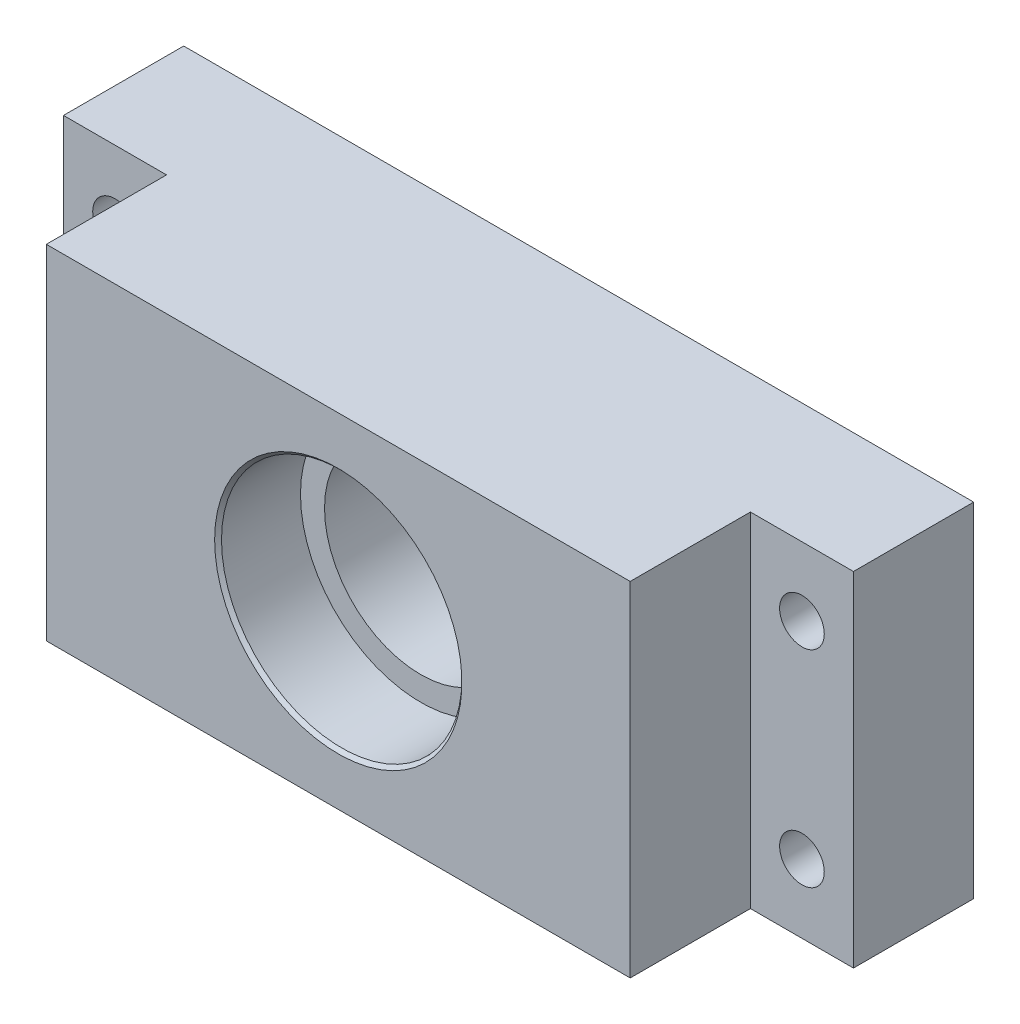
ISO-10303-21;
HEADER;
FILE_DESCRIPTION(('STEP AP214'),'2;1');
FILE_NAME('part.step','',(''),(''),'','','');
FILE_SCHEMA(('AUTOMOTIVE_DESIGN { 1 0 10303 214 1 1 1 1 }'));
ENDSEC;
DATA;
#1=APPLICATION_CONTEXT('core data for automotive mechanical design processes');
#2=APPLICATION_PROTOCOL_DEFINITION('international standard','automotive_design',2000,#1);
#3=PRODUCT_CONTEXT('',#1,'mechanical');
#4=PRODUCT('Part','Part','',(#3));
#5=PRODUCT_RELATED_PRODUCT_CATEGORY('part','',(#4));
#6=PRODUCT_DEFINITION_FORMATION('','',#4);
#7=PRODUCT_DEFINITION_CONTEXT('part definition',#1,'design');
#8=PRODUCT_DEFINITION('design','',#6,#7);
#9=PRODUCT_DEFINITION_SHAPE('','',#8);
#10=(LENGTH_UNIT() NAMED_UNIT(*) SI_UNIT(.MILLI.,.METRE.));
#11=(NAMED_UNIT(*) PLANE_ANGLE_UNIT() SI_UNIT($,.RADIAN.));
#12=(NAMED_UNIT(*) SI_UNIT($,.STERADIAN.) SOLID_ANGLE_UNIT());
#13=UNCERTAINTY_MEASURE_WITH_UNIT(LENGTH_MEASURE(1.E-05),#10,'distance_accuracy_value','');
#14=(GEOMETRIC_REPRESENTATION_CONTEXT(3) GLOBAL_UNCERTAINTY_ASSIGNED_CONTEXT((#13)) GLOBAL_UNIT_ASSIGNED_CONTEXT((#10,
#11,#12)) REPRESENTATION_CONTEXT('',''));
#15=CARTESIAN_POINT('',(0.,0.,0.));
#16=DIRECTION('',(0.,0.,1.));
#17=DIRECTION('',(1.,0.,0.));
#18=AXIS2_PLACEMENT_3D('',#15,#16,#17);
#19=CARTESIAN_POINT('',(57.5,-25.,35.));
#20=DIRECTION('',(-1.,0.,0.));
#21=DIRECTION('',(0.,0.,1.));
#22=AXIS2_PLACEMENT_3D('',#19,#20,#21);
#23=PLANE('',#22);
#24=DIRECTION('',(0.,1.,0.));
#25=VECTOR('',#24,1.);
#26=CARTESIAN_POINT('',(57.5,-25.,17.5));
#27=LINE('',#26,#25);
#28=CARTESIAN_POINT('',(57.5,-25.,17.5));
#29=VERTEX_POINT('',#28);
#30=CARTESIAN_POINT('',(57.5,25.,17.5));
#31=VERTEX_POINT('',#30);
#32=EDGE_CURVE('E104',#29,#31,#27,.T.);
#33=ORIENTED_EDGE('',*,*,#32,.F.);
#34=DIRECTION('',(0.,0.,-1.));
#35=VECTOR('',#34,1.);
#36=CARTESIAN_POINT('',(57.5,-25.,35.));
#37=LINE('',#36,#35);
#38=CARTESIAN_POINT('',(57.5,-25.,0.));
#39=VERTEX_POINT('',#38);
#40=EDGE_CURVE('E380',#29,#39,#37,.T.);
#41=ORIENTED_EDGE('',*,*,#40,.T.);
#42=DIRECTION('',(0.,1.,0.));
#43=VECTOR('',#42,1.);
#44=CARTESIAN_POINT('',(57.5,-25.,0.));
#45=LINE('',#44,#43);
#46=CARTESIAN_POINT('',(57.5,25.,0.));
#47=VERTEX_POINT('',#46);
#48=EDGE_CURVE('E127',#39,#47,#45,.T.);
#49=ORIENTED_EDGE('',*,*,#48,.T.);
#50=DIRECTION('',(0.,0.,-1.));
#51=VECTOR('',#50,1.);
#52=CARTESIAN_POINT('',(57.5,25.,35.));
#53=LINE('',#52,#51);
#54=EDGE_CURVE('E121',#31,#47,#53,.T.);
#55=ORIENTED_EDGE('',*,*,#54,.F.);
#56=EDGE_LOOP('',(#33,#41,#49,#55));
#57=FACE_BOUND('',#56,.T.);
#58=ADVANCED_FACE('F39',(#57),#23,.F.);
#59=CARTESIAN_POINT('',(50.,15.,35.));
#60=DIRECTION('',(0.,0.,-1.));
#61=DIRECTION('',(-1.,0.,0.));
#62=AXIS2_PLACEMENT_3D('',#59,#60,#61);
#63=CYLINDRICAL_SURFACE('',#62,3.25);
#64=CARTESIAN_POINT('',(50.,15.,0.));
#65=DIRECTION('',(0.,0.,-1.));
#66=DIRECTION('',(-1.,0.,0.));
#67=AXIS2_PLACEMENT_3D('',#64,#65,#66);
#68=CIRCLE('',#67,3.25);
#69=CARTESIAN_POINT('',(46.75,15.,0.));
#70=VERTEX_POINT('',#69);
#71=EDGE_CURVE('E425',#70,#70,#68,.T.);
#72=ORIENTED_EDGE('',*,*,#71,.T.);
#73=EDGE_LOOP('',(#72));
#74=FACE_BOUND('',#73,.T.);
#75=CARTESIAN_POINT('',(50.,15.,17.5));
#76=DIRECTION('',(0.,0.,1.));
#77=DIRECTION('',(1.,0.,0.));
#78=AXIS2_PLACEMENT_3D('',#75,#76,#77);
#79=CIRCLE('',#78,3.25);
#80=CARTESIAN_POINT('',(53.25,15.,17.5));
#81=VERTEX_POINT('',#80);
#82=EDGE_CURVE('E149',#81,#81,#79,.F.);
#83=ORIENTED_EDGE('',*,*,#82,.F.);
#84=EDGE_LOOP('',(#83));
#85=FACE_BOUND('',#84,.T.);
#86=ADVANCED_FACE('F172',(#74,#85),#63,.F.);
#87=CARTESIAN_POINT('',(50.,-15.,35.));
#88=DIRECTION('',(0.,0.,-1.));
#89=DIRECTION('',(-1.,0.,0.));
#90=AXIS2_PLACEMENT_3D('',#87,#88,#89);
#91=CYLINDRICAL_SURFACE('',#90,3.25);
#92=CARTESIAN_POINT('',(50.,-15.,0.));
#93=DIRECTION('',(0.,0.,-1.));
#94=DIRECTION('',(-1.,0.,0.));
#95=AXIS2_PLACEMENT_3D('',#92,#93,#94);
#96=CIRCLE('',#95,3.25);
#97=CARTESIAN_POINT('',(46.75,-15.,0.));
#98=VERTEX_POINT('',#97);
#99=EDGE_CURVE('E422',#98,#98,#96,.T.);
#100=ORIENTED_EDGE('',*,*,#99,.T.);
#101=EDGE_LOOP('',(#100));
#102=FACE_BOUND('',#101,.T.);
#103=CARTESIAN_POINT('',(50.,-15.,17.5));
#104=DIRECTION('',(0.,0.,1.));
#105=DIRECTION('',(1.,0.,0.));
#106=AXIS2_PLACEMENT_3D('',#103,#104,#105);
#107=CIRCLE('',#106,3.25);
#108=CARTESIAN_POINT('',(53.25,-15.,17.5));
#109=VERTEX_POINT('',#108);
#110=EDGE_CURVE('E146',#109,#109,#107,.F.);
#111=ORIENTED_EDGE('',*,*,#110,.F.);
#112=EDGE_LOOP('',(#111));
#113=FACE_BOUND('',#112,.T.);
#114=ADVANCED_FACE('F177',(#102,#113),#91,.F.);
#115=CARTESIAN_POINT('',(0.,0.,35.));
#116=DIRECTION('',(0.,0.,-1.));
#117=DIRECTION('',(-1.,0.,0.));
#118=AXIS2_PLACEMENT_3D('',#115,#116,#117);
#119=CYLINDRICAL_SURFACE('',#118,14.);
#120=CARTESIAN_POINT('',(0.,0.,23.));
#121=DIRECTION('',(0.,0.,1.));
#122=DIRECTION('',(1.,0.,0.));
#123=AXIS2_PLACEMENT_3D('',#120,#121,#122);
#124=CIRCLE('',#123,14.);
#125=CARTESIAN_POINT('',(14.,0.,23.));
#126=VERTEX_POINT('',#125);
#127=EDGE_CURVE('E138',#126,#126,#124,.T.);
#128=ORIENTED_EDGE('',*,*,#127,.T.);
#129=EDGE_LOOP('',(#128));
#130=FACE_BOUND('',#129,.T.);
#131=CARTESIAN_POINT('',(0.,0.,12.));
#132=DIRECTION('',(0.,0.,-1.));
#133=DIRECTION('',(-1.,0.,0.));
#134=AXIS2_PLACEMENT_3D('',#131,#132,#133);
#135=CIRCLE('',#134,14.);
#136=CARTESIAN_POINT('',(-14.,0.,12.));
#137=VERTEX_POINT('',#136);
#138=EDGE_CURVE('E142',#137,#137,#135,.T.);
#139=ORIENTED_EDGE('',*,*,#138,.T.);
#140=EDGE_LOOP('',(#139));
#141=FACE_BOUND('',#140,.T.);
#142=ADVANCED_FACE('F204',(#130,#141),#119,.F.);
#143=CARTESIAN_POINT('',(0.,0.,35.));
#144=DIRECTION('',(0.,0.,-1.));
#145=DIRECTION('',(-1.,0.,0.));
#146=AXIS2_PLACEMENT_3D('',#143,#144,#145);
#147=PLANE('',#146);
#148=CARTESIAN_POINT('',(0.,0.,35.));
#149=DIRECTION('',(0.,0.,-1.));
#150=DIRECTION('',(-1.,0.,0.));
#151=AXIS2_PLACEMENT_3D('',#148,#149,#150);
#152=CIRCLE('',#151,18.);
#153=CARTESIAN_POINT('',(-18.,0.,35.));
#154=VERTEX_POINT('',#153);
#155=EDGE_CURVE('E132',#154,#154,#152,.T.);
#156=ORIENTED_EDGE('',*,*,#155,.T.);
#157=EDGE_LOOP('',(#156));
#158=FACE_BOUND('',#157,.T.);
#159=DIRECTION('',(1.,0.,0.));
#160=VECTOR('',#159,1.);
#161=CARTESIAN_POINT('',(-57.5,-25.,35.));
#162=LINE('',#161,#160);
#163=CARTESIAN_POINT('',(-42.5,-25.,35.));
#164=VERTEX_POINT('',#163);
#165=CARTESIAN_POINT('',(42.5,-25.,35.));
#166=VERTEX_POINT('',#165);
#167=EDGE_CURVE('E376',#164,#166,#162,.T.);
#168=ORIENTED_EDGE('',*,*,#167,.T.);
#169=DIRECTION('',(0.,-1.,0.));
#170=VECTOR('',#169,1.);
#171=CARTESIAN_POINT('',(42.5,-25.,35.));
#172=LINE('',#171,#170);
#173=CARTESIAN_POINT('',(42.5,25.,35.));
#174=VERTEX_POINT('',#173);
#175=EDGE_CURVE('E115',#174,#166,#172,.T.);
#176=ORIENTED_EDGE('',*,*,#175,.F.);
#177=DIRECTION('',(-1.,0.,0.));
#178=VECTOR('',#177,1.);
#179=CARTESIAN_POINT('',(-57.5,25.,35.));
#180=LINE('',#179,#178);
#181=CARTESIAN_POINT('',(-42.5,25.,35.));
#182=VERTEX_POINT('',#181);
#183=EDGE_CURVE('E381',#174,#182,#180,.T.);
#184=ORIENTED_EDGE('',*,*,#183,.T.);
#185=DIRECTION('',(0.,1.,0.));
#186=VECTOR('',#185,1.);
#187=CARTESIAN_POINT('',(-42.5,-25.,35.));
#188=LINE('',#187,#186);
#189=EDGE_CURVE('E379',#164,#182,#188,.T.);
#190=ORIENTED_EDGE('',*,*,#189,.F.);
#191=EDGE_LOOP('',(#168,#176,#184,#190));
#192=FACE_BOUND('',#191,.T.);
#193=ADVANCED_FACE('F200',(#158,#192),#147,.F.);
#194=CARTESIAN_POINT('',(0.,0.,0.));
#195=DIRECTION('',(0.,0.,-1.));
#196=DIRECTION('',(-1.,0.,0.));
#197=AXIS2_PLACEMENT_3D('',#194,#195,#196);
#198=PLANE('',#197);
#199=CARTESIAN_POINT('',(0.,0.,0.));
#200=DIRECTION('',(0.,0.,-1.));
#201=DIRECTION('',(-1.,0.,0.));
#202=AXIS2_PLACEMENT_3D('',#199,#200,#201);
#203=CIRCLE('',#202,18.);
#204=CARTESIAN_POINT('',(-18.,0.,0.));
#205=VERTEX_POINT('',#204);
#206=EDGE_CURVE('E11',#205,#205,#203,.F.);
#207=ORIENTED_EDGE('',*,*,#206,.T.);
#208=EDGE_LOOP('',(#207));
#209=FACE_BOUND('',#208,.T.);
#210=ORIENTED_EDGE('',*,*,#99,.F.);
#211=EDGE_LOOP('',(#210));
#212=FACE_BOUND('',#211,.T.);
#213=CARTESIAN_POINT('',(-50.,15.,0.));
#214=DIRECTION('',(0.,0.,-1.));
#215=DIRECTION('',(-1.,0.,0.));
#216=AXIS2_PLACEMENT_3D('',#213,#214,#215);
#217=CIRCLE('',#216,3.25);
#218=CARTESIAN_POINT('',(-53.25,15.,0.));
#219=VERTEX_POINT('',#218);
#220=EDGE_CURVE('E421',#219,#219,#217,.T.);
#221=ORIENTED_EDGE('',*,*,#220,.F.);
#222=EDGE_LOOP('',(#221));
#223=FACE_BOUND('',#222,.T.);
#224=CARTESIAN_POINT('',(-50.,-15.,0.));
#225=DIRECTION('',(0.,0.,-1.));
#226=DIRECTION('',(-1.,0.,0.));
#227=AXIS2_PLACEMENT_3D('',#224,#225,#226);
#228=CIRCLE('',#227,3.25);
#229=CARTESIAN_POINT('',(-53.25,-15.,0.));
#230=VERTEX_POINT('',#229);
#231=EDGE_CURVE('E418',#230,#230,#228,.T.);
#232=ORIENTED_EDGE('',*,*,#231,.F.);
#233=EDGE_LOOP('',(#232));
#234=FACE_BOUND('',#233,.T.);
#235=ORIENTED_EDGE('',*,*,#71,.F.);
#236=EDGE_LOOP('',(#235));
#237=FACE_BOUND('',#236,.T.);
#238=ORIENTED_EDGE('',*,*,#48,.F.);
#239=DIRECTION('',(1.,0.,0.));
#240=VECTOR('',#239,1.);
#241=CARTESIAN_POINT('',(-57.5,-25.,0.));
#242=LINE('',#241,#240);
#243=CARTESIAN_POINT('',(-57.5,-25.,0.));
#244=VERTEX_POINT('',#243);
#245=EDGE_CURVE('E384',#244,#39,#242,.T.);
#246=ORIENTED_EDGE('',*,*,#245,.F.);
#247=DIRECTION('',(0.,-1.,0.));
#248=VECTOR('',#247,1.);
#249=CARTESIAN_POINT('',(-57.5,-25.,0.));
#250=LINE('',#249,#248);
#251=CARTESIAN_POINT('',(-57.5,25.,0.));
#252=VERTEX_POINT('',#251);
#253=EDGE_CURVE('E391',#252,#244,#250,.T.);
#254=ORIENTED_EDGE('',*,*,#253,.F.);
#255=DIRECTION('',(-1.,0.,0.));
#256=VECTOR('',#255,1.);
#257=CARTESIAN_POINT('',(-57.5,25.,0.));
#258=LINE('',#257,#256);
#259=EDGE_CURVE('E389',#47,#252,#258,.T.);
#260=ORIENTED_EDGE('',*,*,#259,.F.);
#261=EDGE_LOOP('',(#238,#246,#254,#260));
#262=FACE_BOUND('',#261,.T.);
#263=ADVANCED_FACE('F189',(#209,#212,#223,#234,#237,#262),#198,.T.);
#264=CARTESIAN_POINT('',(-57.5,25.,35.));
#265=DIRECTION('',(0.,-1.,0.));
#266=DIRECTION('',(0.,0.,-1.));
#267=AXIS2_PLACEMENT_3D('',#264,#265,#266);
#268=PLANE('',#267);
#269=ORIENTED_EDGE('',*,*,#183,.F.);
#270=DIRECTION('',(0.,0.,1.));
#271=VECTOR('',#270,1.);
#272=CARTESIAN_POINT('',(42.5,25.,17.5));
#273=LINE('',#272,#271);
#274=CARTESIAN_POINT('',(42.5,25.,17.5));
#275=VERTEX_POINT('',#274);
#276=EDGE_CURVE('E123',#275,#174,#273,.T.);
#277=ORIENTED_EDGE('',*,*,#276,.F.);
#278=DIRECTION('',(-1.,0.,0.));
#279=VECTOR('',#278,1.);
#280=CARTESIAN_POINT('',(57.5,25.,17.5));
#281=LINE('',#280,#279);
#282=EDGE_CURVE('E108',#31,#275,#281,.T.);
#283=ORIENTED_EDGE('',*,*,#282,.F.);
#284=ORIENTED_EDGE('',*,*,#54,.T.);
#285=ORIENTED_EDGE('',*,*,#259,.T.);
#286=DIRECTION('',(0.,0.,-1.));
#287=VECTOR('',#286,1.);
#288=CARTESIAN_POINT('',(-57.5,25.,35.));
#289=LINE('',#288,#287);
#290=CARTESIAN_POINT('',(-57.5,25.,17.5));
#291=VERTEX_POINT('',#290);
#292=EDGE_CURVE('E129',#291,#252,#289,.T.);
#293=ORIENTED_EDGE('',*,*,#292,.F.);
#294=DIRECTION('',(-1.,0.,0.));
#295=VECTOR('',#294,1.);
#296=CARTESIAN_POINT('',(-57.5,25.,17.5));
#297=LINE('',#296,#295);
#298=CARTESIAN_POINT('',(-42.5,25.,17.5));
#299=VERTEX_POINT('',#298);
#300=EDGE_CURVE('E403',#299,#291,#297,.T.);
#301=ORIENTED_EDGE('',*,*,#300,.F.);
#302=DIRECTION('',(0.,0.,1.));
#303=VECTOR('',#302,1.);
#304=CARTESIAN_POINT('',(-42.5,25.,17.5));
#305=LINE('',#304,#303);
#306=EDGE_CURVE('E372',#299,#182,#305,.T.);
#307=ORIENTED_EDGE('',*,*,#306,.T.);
#308=EDGE_LOOP('',(#269,#277,#283,#284,#285,#293,#301,#307));
#309=FACE_BOUND('',#308,.T.);
#310=ADVANCED_FACE('F119',(#309),#268,.F.);
#311=CARTESIAN_POINT('',(-57.5,-25.,35.));
#312=DIRECTION('',(1.,0.,0.));
#313=DIRECTION('',(0.,0.,-1.));
#314=AXIS2_PLACEMENT_3D('',#311,#312,#313);
#315=PLANE('',#314);
#316=DIRECTION('',(0.,0.,-1.));
#317=VECTOR('',#316,1.);
#318=CARTESIAN_POINT('',(-57.5,-25.,35.));
#319=LINE('',#318,#317);
#320=CARTESIAN_POINT('',(-57.5,-25.,17.5));
#321=VERTEX_POINT('',#320);
#322=EDGE_CURVE('E134',#321,#244,#319,.T.);
#323=ORIENTED_EDGE('',*,*,#322,.F.);
#324=DIRECTION('',(0.,-1.,0.));
#325=VECTOR('',#324,1.);
#326=CARTESIAN_POINT('',(-57.5,-25.,17.5));
#327=LINE('',#326,#325);
#328=EDGE_CURVE('E63',#291,#321,#327,.T.);
#329=ORIENTED_EDGE('',*,*,#328,.F.);
#330=ORIENTED_EDGE('',*,*,#292,.T.);
#331=ORIENTED_EDGE('',*,*,#253,.T.);
#332=EDGE_LOOP('',(#323,#329,#330,#331));
#333=FACE_BOUND('',#332,.T.);
#334=ADVANCED_FACE('F188',(#333),#315,.F.);
#335=CARTESIAN_POINT('',(-57.5,-25.,35.));
#336=DIRECTION('',(0.,1.,0.));
#337=DIRECTION('',(0.,0.,1.));
#338=AXIS2_PLACEMENT_3D('',#335,#336,#337);
#339=PLANE('',#338);
#340=DIRECTION('',(1.,0.,0.));
#341=VECTOR('',#340,1.);
#342=CARTESIAN_POINT('',(57.5,-25.,17.5));
#343=LINE('',#342,#341);
#344=CARTESIAN_POINT('',(42.5,-25.,17.5));
#345=VERTEX_POINT('',#344);
#346=EDGE_CURVE('E111',#345,#29,#343,.T.);
#347=ORIENTED_EDGE('',*,*,#346,.F.);
#348=DIRECTION('',(0.,0.,1.));
#349=VECTOR('',#348,1.);
#350=CARTESIAN_POINT('',(42.5,-25.,17.5));
#351=LINE('',#350,#349);
#352=EDGE_CURVE('E150',#345,#166,#351,.T.);
#353=ORIENTED_EDGE('',*,*,#352,.T.);
#354=ORIENTED_EDGE('',*,*,#167,.F.);
#355=DIRECTION('',(0.,0.,1.));
#356=VECTOR('',#355,1.);
#357=CARTESIAN_POINT('',(-42.5,-25.,17.5));
#358=LINE('',#357,#356);
#359=CARTESIAN_POINT('',(-42.5,-25.,17.5));
#360=VERTEX_POINT('',#359);
#361=EDGE_CURVE('E405',#360,#164,#358,.T.);
#362=ORIENTED_EDGE('',*,*,#361,.F.);
#363=DIRECTION('',(1.,0.,0.));
#364=VECTOR('',#363,1.);
#365=CARTESIAN_POINT('',(-57.5,-25.,17.5));
#366=LINE('',#365,#364);
#367=EDGE_CURVE('E397',#321,#360,#366,.T.);
#368=ORIENTED_EDGE('',*,*,#367,.F.);
#369=ORIENTED_EDGE('',*,*,#322,.T.);
#370=ORIENTED_EDGE('',*,*,#245,.T.);
#371=ORIENTED_EDGE('',*,*,#40,.F.);
#372=EDGE_LOOP('',(#347,#353,#354,#362,#368,#369,#370,#371));
#373=FACE_BOUND('',#372,.T.);
#374=ADVANCED_FACE('F192',(#373),#339,.F.);
#375=CARTESIAN_POINT('',(0.,0.,23.));
#376=DIRECTION('',(0.,0.,1.));
#377=DIRECTION('',(1.,0.,0.));
#378=AXIS2_PLACEMENT_3D('',#375,#376,#377);
#379=CYLINDRICAL_SURFACE('',#378,17.5);
#380=CARTESIAN_POINT('',(0.,0.,34.5));
#381=DIRECTION('',(0.,0.,-1.));
#382=DIRECTION('',(-1.,0.,0.));
#383=AXIS2_PLACEMENT_3D('',#380,#381,#382);
#384=CIRCLE('',#383,17.5);
#385=CARTESIAN_POINT('',(-17.5,0.,34.5));
#386=VERTEX_POINT('',#385);
#387=EDGE_CURVE('E128',#386,#386,#384,.F.);
#388=ORIENTED_EDGE('',*,*,#387,.T.);
#389=EDGE_LOOP('',(#388));
#390=FACE_BOUND('',#389,.T.);
#391=CARTESIAN_POINT('',(0.,0.,23.));
#392=DIRECTION('',(0.,0.,1.));
#393=DIRECTION('',(1.,0.,0.));
#394=AXIS2_PLACEMENT_3D('',#391,#392,#393);
#395=CIRCLE('',#394,17.5);
#396=CARTESIAN_POINT('',(17.5,0.,23.));
#397=VERTEX_POINT('',#396);
#398=EDGE_CURVE('E141',#397,#397,#395,.T.);
#399=ORIENTED_EDGE('',*,*,#398,.F.);
#400=EDGE_LOOP('',(#399));
#401=FACE_BOUND('',#400,.T.);
#402=ADVANCED_FACE('F196',(#390,#401),#379,.F.);
#403=CARTESIAN_POINT('',(0.,0.,23.));
#404=DIRECTION('',(0.,0.,1.));
#405=DIRECTION('',(1.,0.,0.));
#406=AXIS2_PLACEMENT_3D('',#403,#404,#405);
#407=PLANE('',#406);
#408=ORIENTED_EDGE('',*,*,#127,.F.);
#409=EDGE_LOOP('',(#408));
#410=FACE_BOUND('',#409,.T.);
#411=ORIENTED_EDGE('',*,*,#398,.T.);
#412=EDGE_LOOP('',(#411));
#413=FACE_BOUND('',#412,.T.);
#414=ADVANCED_FACE('F211',(#410,#413),#407,.T.);
#415=CARTESIAN_POINT('',(0.,0.,12.));
#416=DIRECTION('',(0.,0.,-1.));
#417=DIRECTION('',(-1.,0.,0.));
#418=AXIS2_PLACEMENT_3D('',#415,#416,#417);
#419=CYLINDRICAL_SURFACE('',#418,17.5);
#420=CARTESIAN_POINT('',(0.,0.,0.5));
#421=DIRECTION('',(0.,0.,-1.));
#422=DIRECTION('',(-1.,0.,0.));
#423=AXIS2_PLACEMENT_3D('',#420,#421,#422);
#424=CIRCLE('',#423,17.5);
#425=CARTESIAN_POINT('',(-17.5,0.,0.5));
#426=VERTEX_POINT('',#425);
#427=EDGE_CURVE('E48',#426,#426,#424,.T.);
#428=ORIENTED_EDGE('',*,*,#427,.T.);
#429=EDGE_LOOP('',(#428));
#430=FACE_BOUND('',#429,.T.);
#431=CARTESIAN_POINT('',(0.,0.,12.));
#432=DIRECTION('',(0.,0.,-1.));
#433=DIRECTION('',(-1.,0.,0.));
#434=AXIS2_PLACEMENT_3D('',#431,#432,#433);
#435=CIRCLE('',#434,17.5);
#436=CARTESIAN_POINT('',(-17.5,0.,12.));
#437=VERTEX_POINT('',#436);
#438=EDGE_CURVE('E145',#437,#437,#435,.T.);
#439=ORIENTED_EDGE('',*,*,#438,.F.);
#440=EDGE_LOOP('',(#439));
#441=FACE_BOUND('',#440,.T.);
#442=ADVANCED_FACE('F159',(#430,#441),#419,.F.);
#443=CARTESIAN_POINT('',(0.,0.,12.));
#444=DIRECTION('',(0.,0.,-1.));
#445=DIRECTION('',(-1.,0.,0.));
#446=AXIS2_PLACEMENT_3D('',#443,#444,#445);
#447=PLANE('',#446);
#448=ORIENTED_EDGE('',*,*,#138,.F.);
#449=EDGE_LOOP('',(#448));
#450=FACE_BOUND('',#449,.T.);
#451=ORIENTED_EDGE('',*,*,#438,.T.);
#452=EDGE_LOOP('',(#451));
#453=FACE_BOUND('',#452,.T.);
#454=ADVANCED_FACE('F218',(#450,#453),#447,.T.);
#455=CARTESIAN_POINT('',(-50.,-15.,35.));
#456=DIRECTION('',(0.,0.,-1.));
#457=DIRECTION('',(-1.,0.,0.));
#458=AXIS2_PLACEMENT_3D('',#455,#456,#457);
#459=CYLINDRICAL_SURFACE('',#458,3.25);
#460=CARTESIAN_POINT('',(-50.,-15.,17.5));
#461=DIRECTION('',(0.,0.,-1.));
#462=DIRECTION('',(-1.,0.,0.));
#463=AXIS2_PLACEMENT_3D('',#460,#461,#462);
#464=CIRCLE('',#463,3.25);
#465=CARTESIAN_POINT('',(-53.25,-15.,17.5));
#466=VERTEX_POINT('',#465);
#467=EDGE_CURVE('E153',#466,#466,#464,.F.);
#468=ORIENTED_EDGE('',*,*,#467,.T.);
#469=EDGE_LOOP('',(#468));
#470=FACE_BOUND('',#469,.T.);
#471=ORIENTED_EDGE('',*,*,#231,.T.);
#472=EDGE_LOOP('',(#471));
#473=FACE_BOUND('',#472,.T.);
#474=ADVANCED_FACE('F220',(#470,#473),#459,.F.);
#475=CARTESIAN_POINT('',(-50.,15.,35.));
#476=DIRECTION('',(0.,0.,-1.));
#477=DIRECTION('',(-1.,0.,0.));
#478=AXIS2_PLACEMENT_3D('',#475,#476,#477);
#479=CYLINDRICAL_SURFACE('',#478,3.25);
#480=CARTESIAN_POINT('',(-50.,15.,17.5));
#481=DIRECTION('',(0.,0.,-1.));
#482=DIRECTION('',(-1.,0.,0.));
#483=AXIS2_PLACEMENT_3D('',#480,#481,#482);
#484=CIRCLE('',#483,3.25);
#485=CARTESIAN_POINT('',(-53.25,15.,17.5));
#486=VERTEX_POINT('',#485);
#487=EDGE_CURVE('E151',#486,#486,#484,.F.);
#488=ORIENTED_EDGE('',*,*,#487,.T.);
#489=EDGE_LOOP('',(#488));
#490=FACE_BOUND('',#489,.T.);
#491=ORIENTED_EDGE('',*,*,#220,.T.);
#492=EDGE_LOOP('',(#491));
#493=FACE_BOUND('',#492,.T.);
#494=ADVANCED_FACE('F223',(#490,#493),#479,.F.);
#495=CARTESIAN_POINT('',(0.,0.,17.5));
#496=DIRECTION('',(0.,0.,1.));
#497=DIRECTION('',(1.,0.,0.));
#498=AXIS2_PLACEMENT_3D('',#495,#496,#497);
#499=PLANE('',#498);
#500=ORIENTED_EDGE('',*,*,#32,.T.);
#501=ORIENTED_EDGE('',*,*,#282,.T.);
#502=DIRECTION('',(0.,-1.,0.));
#503=VECTOR('',#502,1.);
#504=CARTESIAN_POINT('',(42.5,-25.,17.5));
#505=LINE('',#504,#503);
#506=EDGE_CURVE('E55',#275,#345,#505,.T.);
#507=ORIENTED_EDGE('',*,*,#506,.T.);
#508=ORIENTED_EDGE('',*,*,#346,.T.);
#509=EDGE_LOOP('',(#500,#501,#507,#508));
#510=FACE_BOUND('',#509,.T.);
#511=ORIENTED_EDGE('',*,*,#110,.T.);
#512=EDGE_LOOP('',(#511));
#513=FACE_BOUND('',#512,.T.);
#514=ORIENTED_EDGE('',*,*,#82,.T.);
#515=EDGE_LOOP('',(#514));
#516=FACE_BOUND('',#515,.T.);
#517=ADVANCED_FACE('F106',(#510,#513,#516),#499,.T.);
#518=CARTESIAN_POINT('',(42.5,-25.,17.5));
#519=DIRECTION('',(-1.,0.,0.));
#520=DIRECTION('',(0.,0.,1.));
#521=AXIS2_PLACEMENT_3D('',#518,#519,#520);
#522=PLANE('',#521);
#523=ORIENTED_EDGE('',*,*,#175,.T.);
#524=ORIENTED_EDGE('',*,*,#352,.F.);
#525=ORIENTED_EDGE('',*,*,#506,.F.);
#526=ORIENTED_EDGE('',*,*,#276,.T.);
#527=EDGE_LOOP('',(#523,#524,#525,#526));
#528=FACE_BOUND('',#527,.T.);
#529=ADVANCED_FACE('F239',(#528),#522,.F.);
#530=CARTESIAN_POINT('',(0.,0.,17.5));
#531=DIRECTION('',(0.,0.,-1.));
#532=DIRECTION('',(-1.,0.,0.));
#533=AXIS2_PLACEMENT_3D('',#530,#531,#532);
#534=PLANE('',#533);
#535=ORIENTED_EDGE('',*,*,#487,.F.);
#536=EDGE_LOOP('',(#535));
#537=FACE_BOUND('',#536,.T.);
#538=ORIENTED_EDGE('',*,*,#328,.T.);
#539=ORIENTED_EDGE('',*,*,#367,.T.);
#540=DIRECTION('',(0.,1.,0.));
#541=VECTOR('',#540,1.);
#542=CARTESIAN_POINT('',(-42.5,-25.,17.5));
#543=LINE('',#542,#541);
#544=EDGE_CURVE('E406',#360,#299,#543,.T.);
#545=ORIENTED_EDGE('',*,*,#544,.T.);
#546=ORIENTED_EDGE('',*,*,#300,.T.);
#547=EDGE_LOOP('',(#538,#539,#545,#546));
#548=FACE_BOUND('',#547,.T.);
#549=ORIENTED_EDGE('',*,*,#467,.F.);
#550=EDGE_LOOP('',(#549));
#551=FACE_BOUND('',#550,.T.);
#552=ADVANCED_FACE('F235',(#537,#548,#551),#534,.F.);
#553=CARTESIAN_POINT('',(-42.5,-25.,17.5));
#554=DIRECTION('',(1.,0.,0.));
#555=DIRECTION('',(0.,0.,-1.));
#556=AXIS2_PLACEMENT_3D('',#553,#554,#555);
#557=PLANE('',#556);
#558=ORIENTED_EDGE('',*,*,#189,.T.);
#559=ORIENTED_EDGE('',*,*,#306,.F.);
#560=ORIENTED_EDGE('',*,*,#544,.F.);
#561=ORIENTED_EDGE('',*,*,#361,.T.);
#562=EDGE_LOOP('',(#558,#559,#560,#561));
#563=FACE_BOUND('',#562,.T.);
#564=ADVANCED_FACE('F168',(#563),#557,.F.);
#565=CARTESIAN_POINT('',(0.,0.,34.5));
#566=DIRECTION('',(0.,0.,1.));
#567=DIRECTION('',(1.,0.,0.));
#568=AXIS2_PLACEMENT_3D('',#565,#566,#567);
#569=CONICAL_SURFACE('',#568,17.5,0.785398163397452);
#570=ORIENTED_EDGE('',*,*,#155,.F.);
#571=EDGE_LOOP('',(#570));
#572=FACE_BOUND('',#571,.T.);
#573=ORIENTED_EDGE('',*,*,#387,.F.);
#574=EDGE_LOOP('',(#573));
#575=FACE_BOUND('',#574,.T.);
#576=ADVANCED_FACE('F163',(#572,#575),#569,.F.);
#577=CARTESIAN_POINT('',(0.,0.,0.5));
#578=DIRECTION('',(0.,0.,-1.));
#579=DIRECTION('',(-1.,0.,0.));
#580=AXIS2_PLACEMENT_3D('',#577,#578,#579);
#581=CONICAL_SURFACE('',#580,17.5,0.785398163397445);
#582=ORIENTED_EDGE('',*,*,#206,.F.);
#583=EDGE_LOOP('',(#582));
#584=FACE_BOUND('',#583,.T.);
#585=ORIENTED_EDGE('',*,*,#427,.F.);
#586=EDGE_LOOP('',(#585));
#587=FACE_BOUND('',#586,.T.);
#588=ADVANCED_FACE('F42',(#584,#587),#581,.F.);
#589=CLOSED_SHELL('',(#58,#86,#114,#142,#193,#263,#310,#334,#374,#402,#414,#442,#454,#474,#494,
#517,#529,#552,#564,#576,#588));
#590=MANIFOLD_SOLID_BREP('B2',#589);
#591=ADVANCED_BREP_SHAPE_REPRESENTATION('',(#18,#590),#14);
#592=SHAPE_DEFINITION_REPRESENTATION(#9,#591);
ENDSEC;
END-ISO-10303-21;
